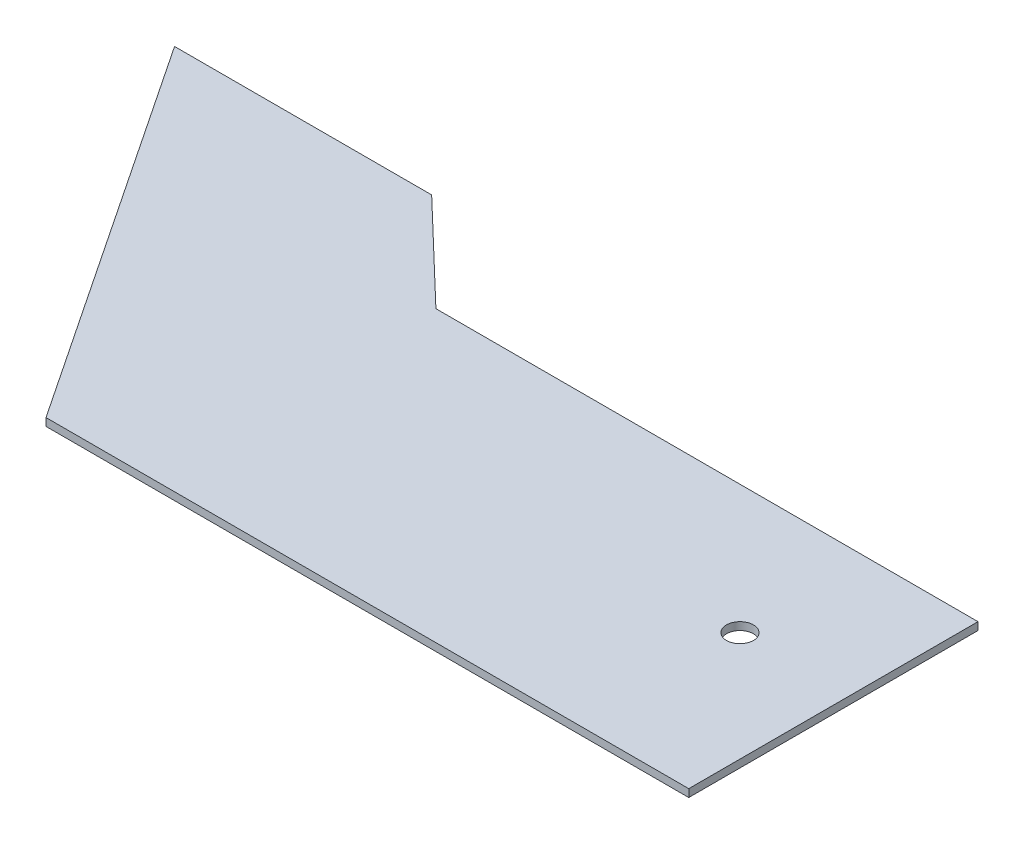
ISO-10303-21;
HEADER;
FILE_DESCRIPTION(('STEP AP214'),'2;1');
FILE_NAME('part.step','',(''),(''),'','','');
FILE_SCHEMA(('AUTOMOTIVE_DESIGN { 1 0 10303 214 1 1 1 1 }'));
ENDSEC;
DATA;
#1=APPLICATION_CONTEXT('core data for automotive mechanical design processes');
#2=APPLICATION_PROTOCOL_DEFINITION('international standard','automotive_design',2000,#1);
#3=PRODUCT_CONTEXT('',#1,'mechanical');
#4=PRODUCT('Part','Part','',(#3));
#5=PRODUCT_RELATED_PRODUCT_CATEGORY('part','',(#4));
#6=PRODUCT_DEFINITION_FORMATION('','',#4);
#7=PRODUCT_DEFINITION_CONTEXT('part definition',#1,'design');
#8=PRODUCT_DEFINITION('design','',#6,#7);
#9=PRODUCT_DEFINITION_SHAPE('','',#8);
#10=(LENGTH_UNIT() NAMED_UNIT(*) SI_UNIT(.MILLI.,.METRE.));
#11=(NAMED_UNIT(*) PLANE_ANGLE_UNIT() SI_UNIT($,.RADIAN.));
#12=(NAMED_UNIT(*) SI_UNIT($,.STERADIAN.) SOLID_ANGLE_UNIT());
#13=UNCERTAINTY_MEASURE_WITH_UNIT(LENGTH_MEASURE(1.E-05),#10,'distance_accuracy_value','');
#14=(GEOMETRIC_REPRESENTATION_CONTEXT(3) GLOBAL_UNCERTAINTY_ASSIGNED_CONTEXT((#13)) GLOBAL_UNIT_ASSIGNED_CONTEXT((#10,
#11,#12)) REPRESENTATION_CONTEXT('',''));
#15=CARTESIAN_POINT('',(0.,0.,0.));
#16=DIRECTION('',(0.,0.,1.));
#17=DIRECTION('',(1.,0.,0.));
#18=AXIS2_PLACEMENT_3D('',#15,#16,#17);
#19=CARTESIAN_POINT('',(0.,1.2,0.));
#20=DIRECTION('',(0.,-1.,0.));
#21=DIRECTION('',(0.,0.,-1.));
#22=AXIS2_PLACEMENT_3D('',#19,#20,#21);
#23=PLANE('',#22);
#24=CARTESIAN_POINT('',(22.3813008150931,1.2,-25.6410049702587));
#25=DIRECTION('',(0.,1.,0.));
#26=DIRECTION('',(0.,0.,1.));
#27=AXIS2_PLACEMENT_3D('',#24,#25,#26);
#28=CIRCLE('',#27,2.1);
#29=CARTESIAN_POINT('',(22.3813008150931,1.2,-23.5410049702587));
#30=VERTEX_POINT('',#29);
#31=EDGE_CURVE('E157',#30,#30,#28,.T.);
#32=ORIENTED_EDGE('',*,*,#31,.F.);
#33=EDGE_LOOP('',(#32));
#34=FACE_BOUND('',#33,.T.);
#35=DIRECTION('',(-1.,0.,0.));
#36=VECTOR('',#35,1.);
#37=CARTESIAN_POINT('',(39.4127274000173,1.2,-45.64029511244));
#38=LINE('',#37,#36);
#39=CARTESIAN_POINT('',(39.4127274000173,1.2,-45.64029511244));
#40=VERTEX_POINT('',#39);
#41=CARTESIAN_POINT('',(-44.9267625287578,1.2,-45.6402951124399));
#42=VERTEX_POINT('',#41);
#43=EDGE_CURVE('E110',#40,#42,#38,.T.);
#44=ORIENTED_EDGE('',*,*,#43,.T.);
#45=DIRECTION('',(-0.722172211943608,0.,-0.691713304987317));
#46=VECTOR('',#45,1.);
#47=CARTESIAN_POINT('',(-44.9267625287578,1.2,-45.64029511244));
#48=LINE('',#47,#46);
#49=CARTESIAN_POINT('',(-60.5872725999827,1.2,-60.6402951124399));
#50=VERTEX_POINT('',#49);
#51=EDGE_CURVE('E113',#42,#50,#48,.T.);
#52=ORIENTED_EDGE('',*,*,#51,.T.);
#53=DIRECTION('',(-1.,0.,0.));
#54=VECTOR('',#53,1.);
#55=CARTESIAN_POINT('',(-60.5872725999827,1.2,-60.6402951124399));
#56=LINE('',#55,#54);
#57=CARTESIAN_POINT('',(-100.587272599983,1.2,-60.6402951124399));
#58=VERTEX_POINT('',#57);
#59=EDGE_CURVE('E129',#50,#58,#56,.T.);
#60=ORIENTED_EDGE('',*,*,#59,.T.);
#61=DIRECTION('',(0.554700196225229,0.,0.832050294337844));
#62=VECTOR('',#61,1.);
#63=CARTESIAN_POINT('',(-100.587272599983,1.2,-60.6402951124399));
#64=LINE('',#63,#62);
#65=CARTESIAN_POINT('',(-60.5872725999827,1.2,-0.640295112439947));
#66=VERTEX_POINT('',#65);
#67=EDGE_CURVE('E142',#58,#66,#64,.T.);
#68=ORIENTED_EDGE('',*,*,#67,.T.);
#69=DIRECTION('',(1.,0.,0.));
#70=VECTOR('',#69,1.);
#71=CARTESIAN_POINT('',(39.4127274000173,1.2,-0.640295112439959));
#72=LINE('',#71,#70);
#73=CARTESIAN_POINT('',(39.4127274000173,1.2,-0.640295112439959));
#74=VERTEX_POINT('',#73);
#75=EDGE_CURVE('E78',#66,#74,#72,.T.);
#76=ORIENTED_EDGE('',*,*,#75,.T.);
#77=DIRECTION('',(0.,0.,-1.));
#78=VECTOR('',#77,1.);
#79=CARTESIAN_POINT('',(39.4127274000173,1.2,-50.64029511244));
#80=LINE('',#79,#78);
#81=EDGE_CURVE('E72',#74,#40,#80,.T.);
#82=ORIENTED_EDGE('',*,*,#81,.T.);
#83=EDGE_LOOP('',(#44,#52,#60,#68,#76,#82));
#84=FACE_BOUND('',#83,.T.);
#85=ADVANCED_FACE('F63',(#34,#84),#23,.F.);
#86=CARTESIAN_POINT('',(0.,0.,0.));
#87=DIRECTION('',(0.,-1.,0.));
#88=DIRECTION('',(0.,0.,-1.));
#89=AXIS2_PLACEMENT_3D('',#86,#87,#88);
#90=PLANE('',#89);
#91=CARTESIAN_POINT('',(22.3813008150931,0.,-25.6410049702587));
#92=DIRECTION('',(0.,1.,0.));
#93=DIRECTION('',(0.,0.,1.));
#94=AXIS2_PLACEMENT_3D('',#91,#92,#93);
#95=CIRCLE('',#94,2.1);
#96=CARTESIAN_POINT('',(22.3813008150931,0.,-23.5410049702587));
#97=VERTEX_POINT('',#96);
#98=EDGE_CURVE('E143',#97,#97,#95,.T.);
#99=ORIENTED_EDGE('',*,*,#98,.T.);
#100=EDGE_LOOP('',(#99));
#101=FACE_BOUND('',#100,.T.);
#102=DIRECTION('',(-0.722172211943608,0.,-0.691713304987317));
#103=VECTOR('',#102,1.);
#104=CARTESIAN_POINT('',(-44.9267625287578,0.,-45.64029511244));
#105=LINE('',#104,#103);
#106=CARTESIAN_POINT('',(-44.9267625287578,0.,-45.6402951124399));
#107=VERTEX_POINT('',#106);
#108=CARTESIAN_POINT('',(-60.5872725999827,0.,-60.6402951124399));
#109=VERTEX_POINT('',#108);
#110=EDGE_CURVE('E149',#107,#109,#105,.T.);
#111=ORIENTED_EDGE('',*,*,#110,.F.);
#112=DIRECTION('',(-1.,0.,0.));
#113=VECTOR('',#112,1.);
#114=CARTESIAN_POINT('',(39.4127274000173,0.,-45.64029511244));
#115=LINE('',#114,#113);
#116=CARTESIAN_POINT('',(39.4127274000173,0.,-45.64029511244));
#117=VERTEX_POINT('',#116);
#118=EDGE_CURVE('E133',#117,#107,#115,.T.);
#119=ORIENTED_EDGE('',*,*,#118,.F.);
#120=DIRECTION('',(0.,0.,-1.));
#121=VECTOR('',#120,1.);
#122=CARTESIAN_POINT('',(39.4127274000173,0.,-50.64029511244));
#123=LINE('',#122,#121);
#124=CARTESIAN_POINT('',(39.4127274000173,0.,-0.640295112439959));
#125=VERTEX_POINT('',#124);
#126=EDGE_CURVE('E164',#125,#117,#123,.T.);
#127=ORIENTED_EDGE('',*,*,#126,.F.);
#128=DIRECTION('',(1.,0.,0.));
#129=VECTOR('',#128,1.);
#130=CARTESIAN_POINT('',(39.4127274000173,0.,-0.640295112439959));
#131=LINE('',#130,#129);
#132=CARTESIAN_POINT('',(-60.5872725999827,0.,-0.640295112439945));
#133=VERTEX_POINT('',#132);
#134=EDGE_CURVE('E160',#133,#125,#131,.T.);
#135=ORIENTED_EDGE('',*,*,#134,.F.);
#136=DIRECTION('',(0.554700196225229,0.,0.832050294337844));
#137=VECTOR('',#136,1.);
#138=CARTESIAN_POINT('',(-100.587272599983,0.,-60.6402951124399));
#139=LINE('',#138,#137);
#140=CARTESIAN_POINT('',(-100.587272599983,0.,-60.6402951124399));
#141=VERTEX_POINT('',#140);
#142=EDGE_CURVE('E135',#141,#133,#139,.T.);
#143=ORIENTED_EDGE('',*,*,#142,.F.);
#144=DIRECTION('',(-1.,0.,0.));
#145=VECTOR('',#144,1.);
#146=CARTESIAN_POINT('',(-60.5872725999827,0.,-60.6402951124399));
#147=LINE('',#146,#145);
#148=EDGE_CURVE('E145',#109,#141,#147,.T.);
#149=ORIENTED_EDGE('',*,*,#148,.F.);
#150=EDGE_LOOP('',(#111,#119,#127,#135,#143,#149));
#151=FACE_BOUND('',#150,.T.);
#152=ADVANCED_FACE('F170',(#101,#151),#90,.T.);
#153=CARTESIAN_POINT('',(39.4127274000173,1.2,-0.640295112439959));
#154=DIRECTION('',(0.,0.,-1.));
#155=DIRECTION('',(-1.,0.,0.));
#156=AXIS2_PLACEMENT_3D('',#153,#154,#155);
#157=PLANE('',#156);
#158=ORIENTED_EDGE('',*,*,#134,.T.);
#159=DIRECTION('',(0.,-1.,0.));
#160=VECTOR('',#159,1.);
#161=CARTESIAN_POINT('',(39.4127274000173,1.2,-0.640295112439959));
#162=LINE('',#161,#160);
#163=EDGE_CURVE('E12',#74,#125,#162,.T.);
#164=ORIENTED_EDGE('',*,*,#163,.F.);
#165=ORIENTED_EDGE('',*,*,#75,.F.);
#166=DIRECTION('',(0.,1.,0.));
#167=VECTOR('',#166,1.);
#168=CARTESIAN_POINT('',(-60.5872725999827,-152.315462117278,-0.640295112439947));
#169=LINE('',#168,#167);
#170=EDGE_CURVE('E138',#133,#66,#169,.T.);
#171=ORIENTED_EDGE('',*,*,#170,.F.);
#172=EDGE_LOOP('',(#158,#164,#165,#171));
#173=FACE_BOUND('',#172,.T.);
#174=ADVANCED_FACE('F65',(#173),#157,.F.);
#175=CARTESIAN_POINT('',(39.4127274000173,1.2,-50.64029511244));
#176=DIRECTION('',(-1.,0.,0.));
#177=DIRECTION('',(0.,0.,1.));
#178=AXIS2_PLACEMENT_3D('',#175,#176,#177);
#179=PLANE('',#178);
#180=ORIENTED_EDGE('',*,*,#126,.T.);
#181=DIRECTION('',(0.,1.,0.));
#182=VECTOR('',#181,1.);
#183=CARTESIAN_POINT('',(39.4127274000173,-152.315462117278,-45.64029511244));
#184=LINE('',#183,#182);
#185=EDGE_CURVE('E120',#117,#40,#184,.T.);
#186=ORIENTED_EDGE('',*,*,#185,.T.);
#187=ORIENTED_EDGE('',*,*,#81,.F.);
#188=ORIENTED_EDGE('',*,*,#163,.T.);
#189=EDGE_LOOP('',(#180,#186,#187,#188));
#190=FACE_BOUND('',#189,.T.);
#191=ADVANCED_FACE('F168',(#190),#179,.F.);
#192=CARTESIAN_POINT('',(22.3813008150931,1.2,-25.6410049702587));
#193=DIRECTION('',(0.,-1.,0.));
#194=DIRECTION('',(0.,0.,-1.));
#195=AXIS2_PLACEMENT_3D('',#192,#193,#194);
#196=CYLINDRICAL_SURFACE('',#195,2.1);
#197=ORIENTED_EDGE('',*,*,#31,.T.);
#198=EDGE_LOOP('',(#197));
#199=FACE_BOUND('',#198,.T.);
#200=ORIENTED_EDGE('',*,*,#98,.F.);
#201=EDGE_LOOP('',(#200));
#202=FACE_BOUND('',#201,.T.);
#203=ADVANCED_FACE('F185',(#199,#202),#196,.F.);
#204=CARTESIAN_POINT('',(39.4127274000173,-152.315462117278,-45.64029511244));
#205=DIRECTION('',(0.,0.,-1.));
#206=DIRECTION('',(-1.,0.,0.));
#207=AXIS2_PLACEMENT_3D('',#204,#205,#206);
#208=PLANE('',#207);
#209=ORIENTED_EDGE('',*,*,#118,.T.);
#210=DIRECTION('',(0.,1.,0.));
#211=VECTOR('',#210,1.);
#212=CARTESIAN_POINT('',(-44.9267625287578,-0.3,-45.6402951124399));
#213=LINE('',#212,#211);
#214=EDGE_CURVE('E125',#107,#42,#213,.T.);
#215=ORIENTED_EDGE('',*,*,#214,.T.);
#216=ORIENTED_EDGE('',*,*,#43,.F.);
#217=ORIENTED_EDGE('',*,*,#185,.F.);
#218=EDGE_LOOP('',(#209,#215,#216,#217));
#219=FACE_BOUND('',#218,.T.);
#220=ADVANCED_FACE('F131',(#219),#208,.T.);
#221=CARTESIAN_POINT('',(-44.9267625287578,-152.315462117278,-45.64029511244));
#222=DIRECTION('',(0.691713304987317,0.,-0.722172211943608));
#223=DIRECTION('',(-0.722172211943608,0.,-0.691713304987317));
#224=AXIS2_PLACEMENT_3D('',#221,#222,#223);
#225=PLANE('',#224);
#226=ORIENTED_EDGE('',*,*,#51,.F.);
#227=ORIENTED_EDGE('',*,*,#214,.F.);
#228=ORIENTED_EDGE('',*,*,#110,.T.);
#229=DIRECTION('',(0.,1.,0.));
#230=VECTOR('',#229,1.);
#231=CARTESIAN_POINT('',(-60.5872725999827,-152.315462117278,-60.6402951124399));
#232=LINE('',#231,#230);
#233=EDGE_CURVE('E127',#109,#50,#232,.T.);
#234=ORIENTED_EDGE('',*,*,#233,.T.);
#235=EDGE_LOOP('',(#226,#227,#228,#234));
#236=FACE_BOUND('',#235,.T.);
#237=ADVANCED_FACE('F124',(#236),#225,.T.);
#238=CARTESIAN_POINT('',(-100.587272599983,-152.315462117278,-60.6402951124399));
#239=DIRECTION('',(-0.832050294337844,0.,0.554700196225229));
#240=DIRECTION('',(0.554700196225229,0.,0.832050294337844));
#241=AXIS2_PLACEMENT_3D('',#238,#239,#240);
#242=PLANE('',#241);
#243=DIRECTION('',(0.,1.,0.));
#244=VECTOR('',#243,1.);
#245=CARTESIAN_POINT('',(-100.587272599983,-152.315462117278,-60.6402951124399));
#246=LINE('',#245,#244);
#247=EDGE_CURVE('E148',#141,#58,#246,.T.);
#248=ORIENTED_EDGE('',*,*,#247,.F.);
#249=ORIENTED_EDGE('',*,*,#142,.T.);
#250=ORIENTED_EDGE('',*,*,#170,.T.);
#251=ORIENTED_EDGE('',*,*,#67,.F.);
#252=EDGE_LOOP('',(#248,#249,#250,#251));
#253=FACE_BOUND('',#252,.T.);
#254=ADVANCED_FACE('F177',(#253),#242,.T.);
#255=CARTESIAN_POINT('',(-60.5872725999827,-152.315462117278,-60.6402951124399));
#256=DIRECTION('',(0.,0.,-1.));
#257=DIRECTION('',(-1.,0.,0.));
#258=AXIS2_PLACEMENT_3D('',#255,#256,#257);
#259=PLANE('',#258);
#260=ORIENTED_EDGE('',*,*,#233,.F.);
#261=ORIENTED_EDGE('',*,*,#148,.T.);
#262=ORIENTED_EDGE('',*,*,#247,.T.);
#263=ORIENTED_EDGE('',*,*,#59,.F.);
#264=EDGE_LOOP('',(#260,#261,#262,#263));
#265=FACE_BOUND('',#264,.T.);
#266=ADVANCED_FACE('F174',(#265),#259,.T.);
#267=CLOSED_SHELL('',(#85,#152,#174,#191,#203,#220,#237,#254,#266));
#268=MANIFOLD_SOLID_BREP('B2',#267);
#269=ADVANCED_BREP_SHAPE_REPRESENTATION('',(#18,#268),#14);
#270=SHAPE_DEFINITION_REPRESENTATION(#9,#269);
ENDSEC;
END-ISO-10303-21;
